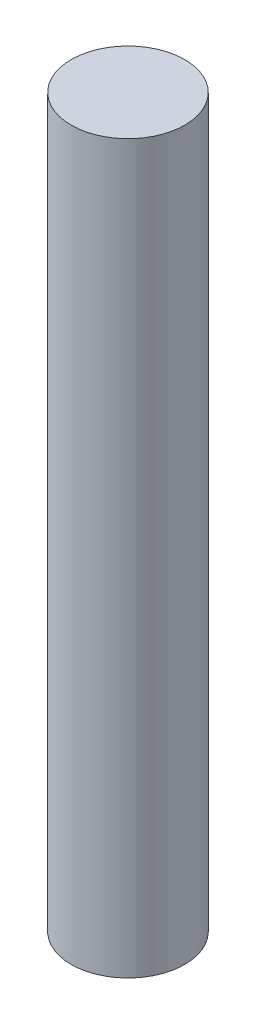
ISO-10303-21;
HEADER;
FILE_DESCRIPTION(('STEP AP214'),'2;1');
FILE_NAME('part.step','',(''),(''),'','','');
FILE_SCHEMA(('AUTOMOTIVE_DESIGN { 1 0 10303 214 1 1 1 1 }'));
ENDSEC;
DATA;
#1=APPLICATION_CONTEXT('core data for automotive mechanical design processes');
#2=APPLICATION_PROTOCOL_DEFINITION('international standard','automotive_design',2000,#1);
#3=PRODUCT_CONTEXT('',#1,'mechanical');
#4=PRODUCT('Part','Part','',(#3));
#5=PRODUCT_RELATED_PRODUCT_CATEGORY('part','',(#4));
#6=PRODUCT_DEFINITION_FORMATION('','',#4);
#7=PRODUCT_DEFINITION_CONTEXT('part definition',#1,'design');
#8=PRODUCT_DEFINITION('design','',#6,#7);
#9=PRODUCT_DEFINITION_SHAPE('','',#8);
#10=(LENGTH_UNIT() NAMED_UNIT(*) SI_UNIT(.MILLI.,.METRE.));
#11=(NAMED_UNIT(*) PLANE_ANGLE_UNIT() SI_UNIT($,.RADIAN.));
#12=(NAMED_UNIT(*) SI_UNIT($,.STERADIAN.) SOLID_ANGLE_UNIT());
#13=UNCERTAINTY_MEASURE_WITH_UNIT(LENGTH_MEASURE(1.E-05),#10,'distance_accuracy_value','');
#14=(GEOMETRIC_REPRESENTATION_CONTEXT(3) GLOBAL_UNCERTAINTY_ASSIGNED_CONTEXT((#13)) GLOBAL_UNIT_ASSIGNED_CONTEXT((#10,
#11,#12)) REPRESENTATION_CONTEXT('',''));
#15=CARTESIAN_POINT('',(0.,0.,0.));
#16=DIRECTION('',(0.,0.,1.));
#17=DIRECTION('',(1.,0.,0.));
#18=AXIS2_PLACEMENT_3D('',#15,#16,#17);
#19=CARTESIAN_POINT('',(0.,40.64,0.));
#20=DIRECTION('',(0.,-1.,0.));
#21=DIRECTION('',(0.,0.,-1.));
#22=AXIS2_PLACEMENT_3D('',#19,#20,#21);
#23=CYLINDRICAL_SURFACE('',#22,3.175);
#24=CARTESIAN_POINT('',(0.,40.64,0.));
#25=DIRECTION('',(0.,1.,0.));
#26=DIRECTION('',(0.,0.,1.));
#27=AXIS2_PLACEMENT_3D('',#24,#25,#26);
#28=CIRCLE('',#27,3.175);
#29=CARTESIAN_POINT('',(0.,40.64,3.175));
#30=VERTEX_POINT('',#29);
#31=EDGE_CURVE('E10',#30,#30,#28,.T.);
#32=ORIENTED_EDGE('',*,*,#31,.F.);
#33=EDGE_LOOP('',(#32));
#34=FACE_BOUND('',#33,.T.);
#35=CARTESIAN_POINT('',(0.,0.,0.));
#36=DIRECTION('',(0.,1.,0.));
#37=DIRECTION('',(0.,0.,1.));
#38=AXIS2_PLACEMENT_3D('',#35,#36,#37);
#39=CIRCLE('',#38,3.175);
#40=CARTESIAN_POINT('',(0.,0.,3.175));
#41=VERTEX_POINT('',#40);
#42=EDGE_CURVE('E34',#41,#41,#39,.T.);
#43=ORIENTED_EDGE('',*,*,#42,.T.);
#44=EDGE_LOOP('',(#43));
#45=FACE_BOUND('',#44,.T.);
#46=ADVANCED_FACE('F31',(#34,#45),#23,.T.);
#47=CARTESIAN_POINT('',(0.,40.64,0.));
#48=DIRECTION('',(0.,1.,0.));
#49=DIRECTION('',(0.,0.,1.));
#50=AXIS2_PLACEMENT_3D('',#47,#48,#49);
#51=PLANE('',#50);
#52=ORIENTED_EDGE('',*,*,#31,.T.);
#53=EDGE_LOOP('',(#52));
#54=FACE_BOUND('',#53,.T.);
#55=ADVANCED_FACE('F46',(#54),#51,.T.);
#56=CARTESIAN_POINT('',(0.,0.,0.));
#57=DIRECTION('',(0.,1.,0.));
#58=DIRECTION('',(0.,0.,1.));
#59=AXIS2_PLACEMENT_3D('',#56,#57,#58);
#60=PLANE('',#59);
#61=ORIENTED_EDGE('',*,*,#42,.F.);
#62=EDGE_LOOP('',(#61));
#63=FACE_BOUND('',#62,.T.);
#64=ADVANCED_FACE('F44',(#63),#60,.F.);
#65=CLOSED_SHELL('',(#46,#55,#64));
#66=MANIFOLD_SOLID_BREP('B2',#65);
#67=ADVANCED_BREP_SHAPE_REPRESENTATION('',(#18,#66),#14);
#68=SHAPE_DEFINITION_REPRESENTATION(#9,#67);
ENDSEC;
END-ISO-10303-21;
